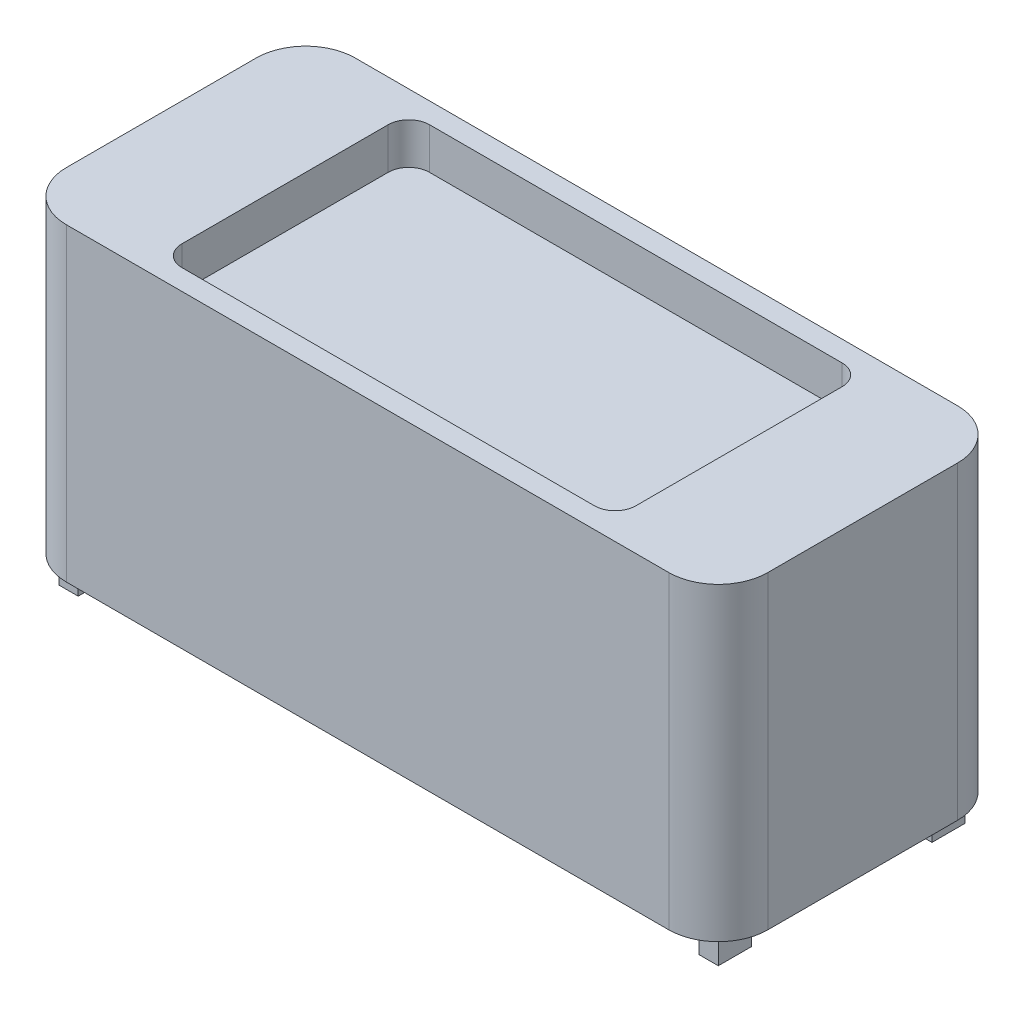
ISO-10303-21;
HEADER;
FILE_DESCRIPTION(('STEP AP214'),'2;1');
FILE_NAME('part.step','',(''),(''),'','','');
FILE_SCHEMA(('AUTOMOTIVE_DESIGN { 1 0 10303 214 1 1 1 1 }'));
ENDSEC;
DATA;
#1=APPLICATION_CONTEXT('core data for automotive mechanical design processes');
#2=APPLICATION_PROTOCOL_DEFINITION('international standard','automotive_design',2000,#1);
#3=PRODUCT_CONTEXT('',#1,'mechanical');
#4=PRODUCT('Part','Part','',(#3));
#5=PRODUCT_RELATED_PRODUCT_CATEGORY('part','',(#4));
#6=PRODUCT_DEFINITION_FORMATION('','',#4);
#7=PRODUCT_DEFINITION_CONTEXT('part definition',#1,'design');
#8=PRODUCT_DEFINITION('design','',#6,#7);
#9=PRODUCT_DEFINITION_SHAPE('','',#8);
#10=(LENGTH_UNIT() NAMED_UNIT(*) SI_UNIT(.MILLI.,.METRE.));
#11=(NAMED_UNIT(*) PLANE_ANGLE_UNIT() SI_UNIT($,.RADIAN.));
#12=(NAMED_UNIT(*) SI_UNIT($,.STERADIAN.) SOLID_ANGLE_UNIT());
#13=UNCERTAINTY_MEASURE_WITH_UNIT(LENGTH_MEASURE(1.E-05),#10,'distance_accuracy_value','');
#14=(GEOMETRIC_REPRESENTATION_CONTEXT(3) GLOBAL_UNCERTAINTY_ASSIGNED_CONTEXT((#13)) GLOBAL_UNIT_ASSIGNED_CONTEXT((#10,
#11,#12)) REPRESENTATION_CONTEXT('',''));
#15=CARTESIAN_POINT('',(0.,0.,0.));
#16=DIRECTION('',(0.,0.,1.));
#17=DIRECTION('',(1.,0.,0.));
#18=AXIS2_PLACEMENT_3D('',#15,#16,#17);
#19=CARTESIAN_POINT('',(0.,-750.,0.));
#20=DIRECTION('',(0.,1.,0.));
#21=DIRECTION('',(0.,0.,1.));
#22=AXIS2_PLACEMENT_3D('',#19,#20,#21);
#23=PLANE('',#22);
#24=DIRECTION('',(1.,0.,0.));
#25=VECTOR('',#24,1.);
#26=CARTESIAN_POINT('',(799.2,-750.,-299.2));
#27=LINE('',#26,#25);
#28=CARTESIAN_POINT('',(752.2,-750.,-299.2));
#29=VERTEX_POINT('',#28);
#30=CARTESIAN_POINT('',(799.2,-750.,-299.2));
#31=VERTEX_POINT('',#30);
#32=EDGE_CURVE('E322',#29,#31,#27,.T.);
#33=ORIENTED_EDGE('',*,*,#32,.F.);
#34=DIRECTION('',(0.,0.,-1.));
#35=VECTOR('',#34,1.);
#36=CARTESIAN_POINT('',(752.2,-750.,-299.2));
#37=LINE('',#36,#35);
#38=CARTESIAN_POINT('',(752.2,-750.,-218.7));
#39=VERTEX_POINT('',#38);
#40=EDGE_CURVE('E338',#39,#29,#37,.T.);
#41=ORIENTED_EDGE('',*,*,#40,.F.);
#42=DIRECTION('',(-1.,0.,0.));
#43=VECTOR('',#42,1.);
#44=CARTESIAN_POINT('',(799.2,-750.,-218.7));
#45=LINE('',#44,#43);
#46=CARTESIAN_POINT('',(799.2,-750.,-218.7));
#47=VERTEX_POINT('',#46);
#48=EDGE_CURVE('E351',#47,#39,#45,.T.);
#49=ORIENTED_EDGE('',*,*,#48,.F.);
#50=DIRECTION('',(0.,0.,1.));
#51=VECTOR('',#50,1.);
#52=CARTESIAN_POINT('',(799.2,-750.,-299.2));
#53=LINE('',#52,#51);
#54=EDGE_CURVE('E327',#31,#47,#53,.T.);
#55=ORIENTED_EDGE('',*,*,#54,.F.);
#56=EDGE_LOOP('',(#33,#41,#49,#55));
#57=FACE_BOUND('',#56,.T.);
#58=DIRECTION('',(0.,0.,-1.));
#59=VECTOR('',#58,1.);
#60=CARTESIAN_POINT('',(-799.2,-750.,299.2));
#61=LINE('',#60,#59);
#62=CARTESIAN_POINT('',(-799.2,-750.,299.2));
#63=VERTEX_POINT('',#62);
#64=CARTESIAN_POINT('',(-799.2,-750.,218.7));
#65=VERTEX_POINT('',#64);
#66=EDGE_CURVE('E418',#63,#65,#61,.T.);
#67=ORIENTED_EDGE('',*,*,#66,.F.);
#68=DIRECTION('',(-1.,0.,0.));
#69=VECTOR('',#68,1.);
#70=CARTESIAN_POINT('',(-799.2,-750.,299.2));
#71=LINE('',#70,#69);
#72=CARTESIAN_POINT('',(-752.2,-750.,299.2));
#73=VERTEX_POINT('',#72);
#74=EDGE_CURVE('E424',#73,#63,#71,.T.);
#75=ORIENTED_EDGE('',*,*,#74,.F.);
#76=DIRECTION('',(0.,0.,1.));
#77=VECTOR('',#76,1.);
#78=CARTESIAN_POINT('',(-752.2,-750.,299.2));
#79=LINE('',#78,#77);
#80=CARTESIAN_POINT('',(-752.2,-750.,218.7));
#81=VERTEX_POINT('',#80);
#82=EDGE_CURVE('E441',#81,#73,#79,.T.);
#83=ORIENTED_EDGE('',*,*,#82,.F.);
#84=DIRECTION('',(1.,0.,0.));
#85=VECTOR('',#84,1.);
#86=CARTESIAN_POINT('',(-799.2,-750.,218.7));
#87=LINE('',#86,#85);
#88=EDGE_CURVE('E437',#65,#81,#87,.T.);
#89=ORIENTED_EDGE('',*,*,#88,.F.);
#90=EDGE_LOOP('',(#67,#75,#83,#89));
#91=FACE_BOUND('',#90,.T.);
#92=DIRECTION('',(1.,0.,0.));
#93=VECTOR('',#92,1.);
#94=CARTESIAN_POINT('',(0.,-750.,-350.));
#95=LINE('',#94,#93);
#96=CARTESIAN_POINT('',(-730.,-750.,-350.));
#97=VERTEX_POINT('',#96);
#98=CARTESIAN_POINT('',(730.,-750.,-350.));
#99=VERTEX_POINT('',#98);
#100=EDGE_CURVE('E496',#97,#99,#95,.T.);
#101=ORIENTED_EDGE('',*,*,#100,.T.);
#102=CARTESIAN_POINT('',(730.,-750.,-230.));
#103=DIRECTION('',(0.,1.,0.));
#104=DIRECTION('',(0.,0.,1.));
#105=AXIS2_PLACEMENT_3D('',#102,#103,#104);
#106=CIRCLE('',#105,120.);
#107=CARTESIAN_POINT('',(850.,-750.,-230.));
#108=VERTEX_POINT('',#107);
#109=EDGE_CURVE('E524',#99,#108,#106,.F.);
#110=ORIENTED_EDGE('',*,*,#109,.T.);
#111=DIRECTION('',(0.,0.,1.));
#112=VECTOR('',#111,1.);
#113=CARTESIAN_POINT('',(850.,-750.,0.));
#114=LINE('',#113,#112);
#115=CARTESIAN_POINT('',(850.,-750.,230.));
#116=VERTEX_POINT('',#115);
#117=EDGE_CURVE('E521',#108,#116,#114,.T.);
#118=ORIENTED_EDGE('',*,*,#117,.T.);
#119=CARTESIAN_POINT('',(730.,-750.,230.));
#120=DIRECTION('',(0.,1.,0.));
#121=DIRECTION('',(0.,0.,1.));
#122=AXIS2_PLACEMENT_3D('',#119,#120,#121);
#123=CIRCLE('',#122,120.);
#124=CARTESIAN_POINT('',(730.,-750.,350.));
#125=VERTEX_POINT('',#124);
#126=EDGE_CURVE('E517',#125,#116,#123,.T.);
#127=ORIENTED_EDGE('',*,*,#126,.F.);
#128=DIRECTION('',(1.,0.,0.));
#129=VECTOR('',#128,1.);
#130=CARTESIAN_POINT('',(0.,-750.,350.));
#131=LINE('',#130,#129);
#132=CARTESIAN_POINT('',(-730.,-750.,350.));
#133=VERTEX_POINT('',#132);
#134=EDGE_CURVE('E513',#133,#125,#131,.T.);
#135=ORIENTED_EDGE('',*,*,#134,.F.);
#136=CARTESIAN_POINT('',(-730.,-750.,230.));
#137=DIRECTION('',(0.,1.,0.));
#138=DIRECTION('',(0.,0.,1.));
#139=AXIS2_PLACEMENT_3D('',#136,#137,#138);
#140=CIRCLE('',#139,120.);
#141=CARTESIAN_POINT('',(-850.,-750.,230.));
#142=VERTEX_POINT('',#141);
#143=EDGE_CURVE('E509',#142,#133,#140,.T.);
#144=ORIENTED_EDGE('',*,*,#143,.F.);
#145=DIRECTION('',(0.,0.,1.));
#146=VECTOR('',#145,1.);
#147=CARTESIAN_POINT('',(-850.,-750.,0.));
#148=LINE('',#147,#146);
#149=CARTESIAN_POINT('',(-850.,-750.,-230.));
#150=VERTEX_POINT('',#149);
#151=EDGE_CURVE('E505',#150,#142,#148,.T.);
#152=ORIENTED_EDGE('',*,*,#151,.F.);
#153=CARTESIAN_POINT('',(-730.,-750.,-230.));
#154=DIRECTION('',(0.,1.,0.));
#155=DIRECTION('',(0.,0.,1.));
#156=AXIS2_PLACEMENT_3D('',#153,#154,#155);
#157=CIRCLE('',#156,120.);
#158=EDGE_CURVE('E500',#97,#150,#157,.T.);
#159=ORIENTED_EDGE('',*,*,#158,.F.);
#160=EDGE_LOOP('',(#101,#110,#118,#127,#135,#144,#152,#159));
#161=FACE_BOUND('',#160,.T.);
#162=DIRECTION('',(0.,0.,1.));
#163=VECTOR('',#162,1.);
#164=CARTESIAN_POINT('',(799.2,-750.,299.2));
#165=LINE('',#164,#163);
#166=CARTESIAN_POINT('',(799.2,-750.,218.7));
#167=VERTEX_POINT('',#166);
#168=CARTESIAN_POINT('',(799.2,-750.,299.2));
#169=VERTEX_POINT('',#168);
#170=EDGE_CURVE('E373',#167,#169,#165,.T.);
#171=ORIENTED_EDGE('',*,*,#170,.F.);
#172=DIRECTION('',(1.,0.,0.));
#173=VECTOR('',#172,1.);
#174=CARTESIAN_POINT('',(799.2,-750.,218.7));
#175=LINE('',#174,#173);
#176=CARTESIAN_POINT('',(752.2,-750.,218.7));
#177=VERTEX_POINT('',#176);
#178=EDGE_CURVE('E379',#177,#167,#175,.T.);
#179=ORIENTED_EDGE('',*,*,#178,.F.);
#180=DIRECTION('',(0.,0.,-1.));
#181=VECTOR('',#180,1.);
#182=CARTESIAN_POINT('',(752.2,-750.,299.2));
#183=LINE('',#182,#181);
#184=CARTESIAN_POINT('',(752.2,-750.,299.2));
#185=VERTEX_POINT('',#184);
#186=EDGE_CURVE('E396',#185,#177,#183,.T.);
#187=ORIENTED_EDGE('',*,*,#186,.F.);
#188=DIRECTION('',(-1.,0.,0.));
#189=VECTOR('',#188,1.);
#190=CARTESIAN_POINT('',(799.2,-750.,299.2));
#191=LINE('',#190,#189);
#192=EDGE_CURVE('E392',#169,#185,#191,.T.);
#193=ORIENTED_EDGE('',*,*,#192,.F.);
#194=EDGE_LOOP('',(#171,#179,#187,#193));
#195=FACE_BOUND('',#194,.T.);
#196=DIRECTION('',(0.,0.,-1.));
#197=VECTOR('',#196,1.);
#198=CARTESIAN_POINT('',(-799.2,-750.,-299.2));
#199=LINE('',#198,#197);
#200=CARTESIAN_POINT('',(-799.2,-750.,-218.7));
#201=VERTEX_POINT('',#200);
#202=CARTESIAN_POINT('',(-799.2,-750.,-299.2));
#203=VERTEX_POINT('',#202);
#204=EDGE_CURVE('E320',#201,#203,#199,.T.);
#205=ORIENTED_EDGE('',*,*,#204,.F.);
#206=DIRECTION('',(-1.,0.,0.));
#207=VECTOR('',#206,1.);
#208=CARTESIAN_POINT('',(-799.2,-750.,-218.7));
#209=LINE('',#208,#207);
#210=CARTESIAN_POINT('',(-752.2,-750.,-218.7));
#211=VERTEX_POINT('',#210);
#212=EDGE_CURVE('E317',#211,#201,#209,.T.);
#213=ORIENTED_EDGE('',*,*,#212,.F.);
#214=DIRECTION('',(0.,0.,1.));
#215=VECTOR('',#214,1.);
#216=CARTESIAN_POINT('',(-752.2,-750.,-299.2));
#217=LINE('',#216,#215);
#218=CARTESIAN_POINT('',(-752.2,-750.,-299.2));
#219=VERTEX_POINT('',#218);
#220=EDGE_CURVE('E110',#219,#211,#217,.T.);
#221=ORIENTED_EDGE('',*,*,#220,.F.);
#222=DIRECTION('',(1.,0.,0.));
#223=VECTOR('',#222,1.);
#224=CARTESIAN_POINT('',(-799.2,-750.,-299.2));
#225=LINE('',#224,#223);
#226=EDGE_CURVE('E105',#203,#219,#225,.T.);
#227=ORIENTED_EDGE('',*,*,#226,.F.);
#228=EDGE_LOOP('',(#205,#213,#221,#227));
#229=FACE_BOUND('',#228,.T.);
#230=ADVANCED_FACE('F89',(#57,#91,#161,#195,#229),#23,.F.);
#231=CARTESIAN_POINT('',(0.,0.,0.));
#232=DIRECTION('',(0.,1.,0.));
#233=DIRECTION('',(0.,0.,1.));
#234=AXIS2_PLACEMENT_3D('',#231,#232,#233);
#235=PLANE('',#234);
#236=DIRECTION('',(1.,0.,0.));
#237=VECTOR('',#236,1.);
#238=CARTESIAN_POINT('',(0.,0.,-350.));
#239=LINE('',#238,#237);
#240=CARTESIAN_POINT('',(-730.,0.,-350.));
#241=VERTEX_POINT('',#240);
#242=CARTESIAN_POINT('',(730.,0.,-350.));
#243=VERTEX_POINT('',#242);
#244=EDGE_CURVE('E481',#241,#243,#239,.T.);
#245=ORIENTED_EDGE('',*,*,#244,.F.);
#246=CARTESIAN_POINT('',(-730.,0.,-230.));
#247=DIRECTION('',(0.,1.,0.));
#248=DIRECTION('',(0.,0.,1.));
#249=AXIS2_PLACEMENT_3D('',#246,#247,#248);
#250=CIRCLE('',#249,120.);
#251=CARTESIAN_POINT('',(-850.,0.,-230.));
#252=VERTEX_POINT('',#251);
#253=EDGE_CURVE('E531',#241,#252,#250,.T.);
#254=ORIENTED_EDGE('',*,*,#253,.T.);
#255=DIRECTION('',(0.,0.,1.));
#256=VECTOR('',#255,1.);
#257=CARTESIAN_POINT('',(-850.,0.,0.));
#258=LINE('',#257,#256);
#259=CARTESIAN_POINT('',(-850.,0.,230.));
#260=VERTEX_POINT('',#259);
#261=EDGE_CURVE('E535',#252,#260,#258,.T.);
#262=ORIENTED_EDGE('',*,*,#261,.T.);
#263=CARTESIAN_POINT('',(-730.,0.,230.));
#264=DIRECTION('',(0.,1.,0.));
#265=DIRECTION('',(0.,0.,1.));
#266=AXIS2_PLACEMENT_3D('',#263,#264,#265);
#267=CIRCLE('',#266,120.);
#268=CARTESIAN_POINT('',(-730.,0.,350.));
#269=VERTEX_POINT('',#268);
#270=EDGE_CURVE('E539',#260,#269,#267,.T.);
#271=ORIENTED_EDGE('',*,*,#270,.T.);
#272=DIRECTION('',(1.,0.,0.));
#273=VECTOR('',#272,1.);
#274=CARTESIAN_POINT('',(0.,0.,350.));
#275=LINE('',#274,#273);
#276=CARTESIAN_POINT('',(730.,0.,350.));
#277=VERTEX_POINT('',#276);
#278=EDGE_CURVE('E543',#269,#277,#275,.T.);
#279=ORIENTED_EDGE('',*,*,#278,.T.);
#280=CARTESIAN_POINT('',(730.,0.,230.));
#281=DIRECTION('',(0.,1.,0.));
#282=DIRECTION('',(0.,0.,1.));
#283=AXIS2_PLACEMENT_3D('',#280,#281,#282);
#284=CIRCLE('',#283,120.);
#285=CARTESIAN_POINT('',(850.,0.,230.));
#286=VERTEX_POINT('',#285);
#287=EDGE_CURVE('E547',#277,#286,#284,.T.);
#288=ORIENTED_EDGE('',*,*,#287,.T.);
#289=DIRECTION('',(0.,0.,1.));
#290=VECTOR('',#289,1.);
#291=CARTESIAN_POINT('',(850.,0.,0.));
#292=LINE('',#291,#290);
#293=CARTESIAN_POINT('',(850.,0.,-230.));
#294=VERTEX_POINT('',#293);
#295=EDGE_CURVE('E551',#294,#286,#292,.T.);
#296=ORIENTED_EDGE('',*,*,#295,.F.);
#297=CARTESIAN_POINT('',(730.,0.,-230.));
#298=DIRECTION('',(0.,1.,0.));
#299=DIRECTION('',(0.,0.,1.));
#300=AXIS2_PLACEMENT_3D('',#297,#298,#299);
#301=CIRCLE('',#300,120.);
#302=EDGE_CURVE('E501',#243,#294,#301,.F.);
#303=ORIENTED_EDGE('',*,*,#302,.F.);
#304=EDGE_LOOP('',(#245,#254,#262,#271,#279,#288,#296,#303));
#305=FACE_BOUND('',#304,.T.);
#306=DIRECTION('',(0.,0.,1.));
#307=VECTOR('',#306,1.);
#308=CARTESIAN_POINT('',(-550.,0.,1.01770443923973E-13));
#309=LINE('',#308,#307);
#310=CARTESIAN_POINT('',(-550.,0.,-249.999999924));
#311=VERTEX_POINT('',#310);
#312=CARTESIAN_POINT('',(-550.,0.,249.999999924));
#313=VERTEX_POINT('',#312);
#314=EDGE_CURVE('E489',#311,#313,#309,.T.);
#315=ORIENTED_EDGE('',*,*,#314,.F.);
#316=CARTESIAN_POINT('',(-499.999999924,0.,-249.999999924));
#317=DIRECTION('',(0.,1.,0.));
#318=DIRECTION('',(0.,0.,1.));
#319=AXIS2_PLACEMENT_3D('',#316,#317,#318);
#320=CIRCLE('',#319,50.000000076);
#321=CARTESIAN_POINT('',(-499.999999924,0.,-300.));
#322=VERTEX_POINT('',#321);
#323=EDGE_CURVE('E12',#311,#322,#320,.F.);
#324=ORIENTED_EDGE('',*,*,#323,.T.);
#325=DIRECTION('',(1.,0.,0.));
#326=VECTOR('',#325,1.);
#327=CARTESIAN_POINT('',(0.,0.,-300.));
#328=LINE('',#327,#326);
#329=CARTESIAN_POINT('',(499.999999924,0.,-300.));
#330=VERTEX_POINT('',#329);
#331=EDGE_CURVE('E485',#322,#330,#328,.T.);
#332=ORIENTED_EDGE('',*,*,#331,.T.);
#333=CARTESIAN_POINT('',(499.999999924,0.,-249.999999924));
#334=DIRECTION('',(0.,1.,0.));
#335=DIRECTION('',(0.,0.,1.));
#336=AXIS2_PLACEMENT_3D('',#333,#334,#335);
#337=CIRCLE('',#336,50.000000076);
#338=CARTESIAN_POINT('',(550.,0.,-249.999999924));
#339=VERTEX_POINT('',#338);
#340=EDGE_CURVE('E98',#330,#339,#337,.F.);
#341=ORIENTED_EDGE('',*,*,#340,.T.);
#342=DIRECTION('',(0.,0.,1.));
#343=VECTOR('',#342,1.);
#344=CARTESIAN_POINT('',(550.,0.,-1.01770443923973E-13));
#345=LINE('',#344,#343);
#346=CARTESIAN_POINT('',(550.,0.,249.999999924));
#347=VERTEX_POINT('',#346);
#348=EDGE_CURVE('E463',#339,#347,#345,.T.);
#349=ORIENTED_EDGE('',*,*,#348,.T.);
#350=CARTESIAN_POINT('',(499.999999924,0.,249.999999924));
#351=DIRECTION('',(0.,1.,0.));
#352=DIRECTION('',(0.,0.,1.));
#353=AXIS2_PLACEMENT_3D('',#350,#351,#352);
#354=CIRCLE('',#353,50.000000076);
#355=CARTESIAN_POINT('',(499.999999924,0.,300.));
#356=VERTEX_POINT('',#355);
#357=EDGE_CURVE('E622',#347,#356,#354,.F.);
#358=ORIENTED_EDGE('',*,*,#357,.T.);
#359=DIRECTION('',(1.,0.,0.));
#360=VECTOR('',#359,1.);
#361=CARTESIAN_POINT('',(0.,0.,300.));
#362=LINE('',#361,#360);
#363=CARTESIAN_POINT('',(-499.999999924,0.,300.));
#364=VERTEX_POINT('',#363);
#365=EDGE_CURVE('E469',#364,#356,#362,.T.);
#366=ORIENTED_EDGE('',*,*,#365,.F.);
#367=CARTESIAN_POINT('',(-499.999999924,0.,249.999999924));
#368=DIRECTION('',(0.,1.,0.));
#369=DIRECTION('',(0.,0.,1.));
#370=AXIS2_PLACEMENT_3D('',#367,#368,#369);
#371=CIRCLE('',#370,50.000000076);
#372=EDGE_CURVE('E625',#364,#313,#371,.F.);
#373=ORIENTED_EDGE('',*,*,#372,.T.);
#374=EDGE_LOOP('',(#315,#324,#332,#341,#349,#358,#366,#373));
#375=FACE_BOUND('',#374,.T.);
#376=ADVANCED_FACE('F631',(#305,#375),#235,.T.);
#377=CARTESIAN_POINT('',(-730.,-750.,230.));
#378=DIRECTION('',(0.,1.,0.));
#379=DIRECTION('',(0.,0.,1.));
#380=AXIS2_PLACEMENT_3D('',#377,#378,#379);
#381=CYLINDRICAL_SURFACE('',#380,120.);
#382=ORIENTED_EDGE('',*,*,#270,.F.);
#383=DIRECTION('',(0.,1.,0.));
#384=VECTOR('',#383,1.);
#385=CARTESIAN_POINT('',(-850.,-750.,230.));
#386=LINE('',#385,#384);
#387=EDGE_CURVE('E575',#142,#260,#386,.T.);
#388=ORIENTED_EDGE('',*,*,#387,.F.);
#389=ORIENTED_EDGE('',*,*,#143,.T.);
#390=DIRECTION('',(0.,1.,0.));
#391=VECTOR('',#390,1.);
#392=CARTESIAN_POINT('',(-730.,-750.,350.));
#393=LINE('',#392,#391);
#394=EDGE_CURVE('E572',#133,#269,#393,.T.);
#395=ORIENTED_EDGE('',*,*,#394,.T.);
#396=EDGE_LOOP('',(#382,#388,#389,#395));
#397=FACE_BOUND('',#396,.T.);
#398=ADVANCED_FACE('F682',(#397),#381,.T.);
#399=CARTESIAN_POINT('',(0.,-750.,350.));
#400=DIRECTION('',(0.,0.,1.));
#401=DIRECTION('',(1.,0.,0.));
#402=AXIS2_PLACEMENT_3D('',#399,#400,#401);
#403=PLANE('',#402);
#404=ORIENTED_EDGE('',*,*,#278,.F.);
#405=ORIENTED_EDGE('',*,*,#394,.F.);
#406=ORIENTED_EDGE('',*,*,#134,.T.);
#407=DIRECTION('',(0.,1.,0.));
#408=VECTOR('',#407,1.);
#409=CARTESIAN_POINT('',(730.,-750.,350.));
#410=LINE('',#409,#408);
#411=EDGE_CURVE('E569',#125,#277,#410,.T.);
#412=ORIENTED_EDGE('',*,*,#411,.T.);
#413=EDGE_LOOP('',(#404,#405,#406,#412));
#414=FACE_BOUND('',#413,.T.);
#415=ADVANCED_FACE('F701',(#414),#403,.T.);
#416=CARTESIAN_POINT('',(730.,-750.,230.));
#417=DIRECTION('',(0.,1.,0.));
#418=DIRECTION('',(0.,0.,1.));
#419=AXIS2_PLACEMENT_3D('',#416,#417,#418);
#420=CYLINDRICAL_SURFACE('',#419,120.);
#421=ORIENTED_EDGE('',*,*,#287,.F.);
#422=ORIENTED_EDGE('',*,*,#411,.F.);
#423=ORIENTED_EDGE('',*,*,#126,.T.);
#424=DIRECTION('',(0.,1.,0.));
#425=VECTOR('',#424,1.);
#426=CARTESIAN_POINT('',(850.,-750.,230.));
#427=LINE('',#426,#425);
#428=EDGE_CURVE('E566',#116,#286,#427,.T.);
#429=ORIENTED_EDGE('',*,*,#428,.T.);
#430=EDGE_LOOP('',(#421,#422,#423,#429));
#431=FACE_BOUND('',#430,.T.);
#432=ADVANCED_FACE('F697',(#431),#420,.T.);
#433=CARTESIAN_POINT('',(850.,-750.,0.));
#434=DIRECTION('',(-1.,0.,0.));
#435=DIRECTION('',(0.,0.,1.));
#436=AXIS2_PLACEMENT_3D('',#433,#434,#435);
#437=PLANE('',#436);
#438=ORIENTED_EDGE('',*,*,#295,.T.);
#439=ORIENTED_EDGE('',*,*,#428,.F.);
#440=ORIENTED_EDGE('',*,*,#117,.F.);
#441=DIRECTION('',(0.,1.,0.));
#442=VECTOR('',#441,1.);
#443=CARTESIAN_POINT('',(850.,-750.,-230.));
#444=LINE('',#443,#442);
#445=EDGE_CURVE('E562',#108,#294,#444,.T.);
#446=ORIENTED_EDGE('',*,*,#445,.T.);
#447=EDGE_LOOP('',(#438,#439,#440,#446));
#448=FACE_BOUND('',#447,.T.);
#449=ADVANCED_FACE('F693',(#448),#437,.F.);
#450=CARTESIAN_POINT('',(730.,-750.,-230.));
#451=DIRECTION('',(0.,1.,0.));
#452=DIRECTION('',(0.,0.,1.));
#453=AXIS2_PLACEMENT_3D('',#450,#451,#452);
#454=CYLINDRICAL_SURFACE('',#453,120.);
#455=ORIENTED_EDGE('',*,*,#302,.T.);
#456=ORIENTED_EDGE('',*,*,#445,.F.);
#457=ORIENTED_EDGE('',*,*,#109,.F.);
#458=DIRECTION('',(0.,1.,0.));
#459=VECTOR('',#458,1.);
#460=CARTESIAN_POINT('',(730.,-750.,-350.));
#461=LINE('',#460,#459);
#462=EDGE_CURVE('E557',#99,#243,#461,.T.);
#463=ORIENTED_EDGE('',*,*,#462,.T.);
#464=EDGE_LOOP('',(#455,#456,#457,#463));
#465=FACE_BOUND('',#464,.T.);
#466=ADVANCED_FACE('F689',(#465),#454,.T.);
#467=CARTESIAN_POINT('',(0.,-750.,-350.));
#468=DIRECTION('',(0.,0.,1.));
#469=DIRECTION('',(1.,0.,0.));
#470=AXIS2_PLACEMENT_3D('',#467,#468,#469);
#471=PLANE('',#470);
#472=ORIENTED_EDGE('',*,*,#244,.T.);
#473=ORIENTED_EDGE('',*,*,#462,.F.);
#474=ORIENTED_EDGE('',*,*,#100,.F.);
#475=DIRECTION('',(0.,1.,0.));
#476=VECTOR('',#475,1.);
#477=CARTESIAN_POINT('',(-730.,-750.,-350.));
#478=LINE('',#477,#476);
#479=EDGE_CURVE('E527',#97,#241,#478,.T.);
#480=ORIENTED_EDGE('',*,*,#479,.T.);
#481=EDGE_LOOP('',(#472,#473,#474,#480));
#482=FACE_BOUND('',#481,.T.);
#483=ADVANCED_FACE('F692',(#482),#471,.F.);
#484=CARTESIAN_POINT('',(-730.,-750.,-230.));
#485=DIRECTION('',(0.,1.,0.));
#486=DIRECTION('',(0.,0.,1.));
#487=AXIS2_PLACEMENT_3D('',#484,#485,#486);
#488=CYLINDRICAL_SURFACE('',#487,120.);
#489=ORIENTED_EDGE('',*,*,#253,.F.);
#490=ORIENTED_EDGE('',*,*,#479,.F.);
#491=ORIENTED_EDGE('',*,*,#158,.T.);
#492=DIRECTION('',(0.,1.,0.));
#493=VECTOR('',#492,1.);
#494=CARTESIAN_POINT('',(-850.,-750.,-230.));
#495=LINE('',#494,#493);
#496=EDGE_CURVE('E578',#150,#252,#495,.T.);
#497=ORIENTED_EDGE('',*,*,#496,.T.);
#498=EDGE_LOOP('',(#489,#490,#491,#497));
#499=FACE_BOUND('',#498,.T.);
#500=ADVANCED_FACE('F712',(#499),#488,.T.);
#501=CARTESIAN_POINT('',(-850.,-750.,0.));
#502=DIRECTION('',(-1.,0.,0.));
#503=DIRECTION('',(0.,0.,1.));
#504=AXIS2_PLACEMENT_3D('',#501,#502,#503);
#505=PLANE('',#504);
#506=ORIENTED_EDGE('',*,*,#261,.F.);
#507=ORIENTED_EDGE('',*,*,#496,.F.);
#508=ORIENTED_EDGE('',*,*,#151,.T.);
#509=ORIENTED_EDGE('',*,*,#387,.T.);
#510=EDGE_LOOP('',(#506,#507,#508,#509));
#511=FACE_BOUND('',#510,.T.);
#512=ADVANCED_FACE('F709',(#511),#505,.T.);
#513=CARTESIAN_POINT('',(550.,-100.,-1.01770443923973E-13));
#514=DIRECTION('',(-1.,0.,0.));
#515=DIRECTION('',(0.,0.,1.));
#516=AXIS2_PLACEMENT_3D('',#513,#514,#515);
#517=PLANE('',#516);
#518=DIRECTION('',(0.,0.,1.));
#519=VECTOR('',#518,1.);
#520=CARTESIAN_POINT('',(550.,-100.,-1.01770443923973E-13));
#521=LINE('',#520,#519);
#522=CARTESIAN_POINT('',(550.,-100.,-249.999999924));
#523=VERTEX_POINT('',#522);
#524=CARTESIAN_POINT('',(550.,-100.,249.999999924));
#525=VERTEX_POINT('',#524);
#526=EDGE_CURVE('E464',#523,#525,#521,.T.);
#527=ORIENTED_EDGE('',*,*,#526,.T.);
#528=DIRECTION('',(0.,1.,0.));
#529=VECTOR('',#528,1.);
#530=CARTESIAN_POINT('',(550.,-100.,249.999999924));
#531=LINE('',#530,#529);
#532=EDGE_CURVE('E585',#525,#347,#531,.T.);
#533=ORIENTED_EDGE('',*,*,#532,.T.);
#534=ORIENTED_EDGE('',*,*,#348,.F.);
#535=DIRECTION('',(0.,1.,0.));
#536=VECTOR('',#535,1.);
#537=CARTESIAN_POINT('',(550.,-100.,-249.999999924));
#538=LINE('',#537,#536);
#539=EDGE_CURVE('E561',#339,#523,#538,.F.);
#540=ORIENTED_EDGE('',*,*,#539,.T.);
#541=EDGE_LOOP('',(#527,#533,#534,#540));
#542=FACE_BOUND('',#541,.T.);
#543=ADVANCED_FACE('F637',(#542),#517,.T.);
#544=CARTESIAN_POINT('',(0.,-100.,300.));
#545=DIRECTION('',(0.,0.,1.));
#546=DIRECTION('',(1.,0.,0.));
#547=AXIS2_PLACEMENT_3D('',#544,#545,#546);
#548=PLANE('',#547);
#549=ORIENTED_EDGE('',*,*,#365,.T.);
#550=DIRECTION('',(0.,1.,0.));
#551=VECTOR('',#550,1.);
#552=CARTESIAN_POINT('',(499.999999924,-100.,300.));
#553=LINE('',#552,#551);
#554=CARTESIAN_POINT('',(499.999999924,-100.,300.));
#555=VERTEX_POINT('',#554);
#556=EDGE_CURVE('E593',#356,#555,#553,.F.);
#557=ORIENTED_EDGE('',*,*,#556,.T.);
#558=DIRECTION('',(1.,0.,0.));
#559=VECTOR('',#558,1.);
#560=CARTESIAN_POINT('',(0.,-100.,300.));
#561=LINE('',#560,#559);
#562=CARTESIAN_POINT('',(-499.999999924,-100.,300.));
#563=VERTEX_POINT('',#562);
#564=EDGE_CURVE('E477',#563,#555,#561,.T.);
#565=ORIENTED_EDGE('',*,*,#564,.F.);
#566=DIRECTION('',(0.,1.,0.));
#567=VECTOR('',#566,1.);
#568=CARTESIAN_POINT('',(-499.999999924,0.,300.));
#569=LINE('',#568,#567);
#570=EDGE_CURVE('E589',#563,#364,#569,.T.);
#571=ORIENTED_EDGE('',*,*,#570,.T.);
#572=EDGE_LOOP('',(#549,#557,#565,#571));
#573=FACE_BOUND('',#572,.T.);
#574=ADVANCED_FACE('F662',(#573),#548,.F.);
#575=CARTESIAN_POINT('',(-550.,-100.,1.01770443923973E-13));
#576=DIRECTION('',(-1.,0.,0.));
#577=DIRECTION('',(0.,0.,1.));
#578=AXIS2_PLACEMENT_3D('',#575,#576,#577);
#579=PLANE('',#578);
#580=ORIENTED_EDGE('',*,*,#314,.T.);
#581=DIRECTION('',(0.,1.,0.));
#582=VECTOR('',#581,1.);
#583=CARTESIAN_POINT('',(-550.,-100.,249.999999924));
#584=LINE('',#583,#582);
#585=CARTESIAN_POINT('',(-550.,-100.,249.999999924));
#586=VERTEX_POINT('',#585);
#587=EDGE_CURVE('E612',#313,#586,#584,.F.);
#588=ORIENTED_EDGE('',*,*,#587,.T.);
#589=DIRECTION('',(0.,0.,1.));
#590=VECTOR('',#589,1.);
#591=CARTESIAN_POINT('',(-550.,-100.,1.01770443923973E-13));
#592=LINE('',#591,#590);
#593=CARTESIAN_POINT('',(-550.,-100.,-249.999999924));
#594=VERTEX_POINT('',#593);
#595=EDGE_CURVE('E473',#594,#586,#592,.T.);
#596=ORIENTED_EDGE('',*,*,#595,.F.);
#597=DIRECTION('',(0.,1.,0.));
#598=VECTOR('',#597,1.);
#599=CARTESIAN_POINT('',(-550.,-100.,-249.999999924));
#600=LINE('',#599,#598);
#601=EDGE_CURVE('E608',#594,#311,#600,.T.);
#602=ORIENTED_EDGE('',*,*,#601,.T.);
#603=EDGE_LOOP('',(#580,#588,#596,#602));
#604=FACE_BOUND('',#603,.T.);
#605=ADVANCED_FACE('F654',(#604),#579,.F.);
#606=CARTESIAN_POINT('',(0.,-100.,-300.));
#607=DIRECTION('',(0.,0.,1.));
#608=DIRECTION('',(1.,0.,0.));
#609=AXIS2_PLACEMENT_3D('',#606,#607,#608);
#610=PLANE('',#609);
#611=DIRECTION('',(1.,0.,0.));
#612=VECTOR('',#611,1.);
#613=CARTESIAN_POINT('',(0.,-100.,-300.));
#614=LINE('',#613,#612);
#615=CARTESIAN_POINT('',(-499.999999924,-100.,-300.));
#616=VERTEX_POINT('',#615);
#617=CARTESIAN_POINT('',(499.999999924,-100.,-300.));
#618=VERTEX_POINT('',#617);
#619=EDGE_CURVE('E468',#616,#618,#614,.T.);
#620=ORIENTED_EDGE('',*,*,#619,.T.);
#621=DIRECTION('',(0.,1.,0.));
#622=VECTOR('',#621,1.);
#623=CARTESIAN_POINT('',(499.999999924,0.,-300.));
#624=LINE('',#623,#622);
#625=EDGE_CURVE('E618',#618,#330,#624,.T.);
#626=ORIENTED_EDGE('',*,*,#625,.T.);
#627=ORIENTED_EDGE('',*,*,#331,.F.);
#628=DIRECTION('',(0.,1.,0.));
#629=VECTOR('',#628,1.);
#630=CARTESIAN_POINT('',(-499.999999924,-100.,-300.));
#631=LINE('',#630,#629);
#632=EDGE_CURVE('E615',#322,#616,#631,.F.);
#633=ORIENTED_EDGE('',*,*,#632,.T.);
#634=EDGE_LOOP('',(#620,#626,#627,#633));
#635=FACE_BOUND('',#634,.T.);
#636=ADVANCED_FACE('F647',(#635),#610,.T.);
#637=CARTESIAN_POINT('',(0.,-100.,0.));
#638=DIRECTION('',(0.,1.,0.));
#639=DIRECTION('',(0.,0.,1.));
#640=AXIS2_PLACEMENT_3D('',#637,#638,#639);
#641=PLANE('',#640);
#642=ORIENTED_EDGE('',*,*,#564,.T.);
#643=CARTESIAN_POINT('',(499.999999924,-100.,249.999999924));
#644=DIRECTION('',(0.,1.,0.));
#645=DIRECTION('',(0.,0.,1.));
#646=AXIS2_PLACEMENT_3D('',#643,#644,#645);
#647=CIRCLE('',#646,50.000000076);
#648=EDGE_CURVE('E605',#555,#525,#647,.T.);
#649=ORIENTED_EDGE('',*,*,#648,.T.);
#650=ORIENTED_EDGE('',*,*,#526,.F.);
#651=CARTESIAN_POINT('',(499.999999924,-100.,-249.999999924));
#652=DIRECTION('',(0.,1.,0.));
#653=DIRECTION('',(0.,0.,1.));
#654=AXIS2_PLACEMENT_3D('',#651,#652,#653);
#655=CIRCLE('',#654,50.000000076);
#656=EDGE_CURVE('E599',#523,#618,#655,.T.);
#657=ORIENTED_EDGE('',*,*,#656,.T.);
#658=ORIENTED_EDGE('',*,*,#619,.F.);
#659=CARTESIAN_POINT('',(-499.999999924,-100.,-249.999999924));
#660=DIRECTION('',(0.,1.,0.));
#661=DIRECTION('',(0.,0.,1.));
#662=AXIS2_PLACEMENT_3D('',#659,#660,#661);
#663=CIRCLE('',#662,50.000000076);
#664=EDGE_CURVE('E596',#616,#594,#663,.T.);
#665=ORIENTED_EDGE('',*,*,#664,.T.);
#666=ORIENTED_EDGE('',*,*,#595,.T.);
#667=CARTESIAN_POINT('',(-499.999999924,-100.,249.999999924));
#668=DIRECTION('',(0.,1.,0.));
#669=DIRECTION('',(0.,0.,1.));
#670=AXIS2_PLACEMENT_3D('',#667,#668,#669);
#671=CIRCLE('',#670,50.000000076);
#672=EDGE_CURVE('E602',#586,#563,#671,.T.);
#673=ORIENTED_EDGE('',*,*,#672,.T.);
#674=EDGE_LOOP('',(#642,#649,#650,#657,#658,#665,#666,#673));
#675=FACE_BOUND('',#674,.T.);
#676=ADVANCED_FACE('F644',(#675),#641,.T.);
#677=CARTESIAN_POINT('',(499.999999924,-100.,249.999999924));
#678=DIRECTION('',(0.,1.,0.));
#679=DIRECTION('',(0.,0.,1.));
#680=AXIS2_PLACEMENT_3D('',#677,#678,#679);
#681=CYLINDRICAL_SURFACE('',#680,50.000000076);
#682=ORIENTED_EDGE('',*,*,#648,.F.);
#683=ORIENTED_EDGE('',*,*,#556,.F.);
#684=ORIENTED_EDGE('',*,*,#357,.F.);
#685=ORIENTED_EDGE('',*,*,#532,.F.);
#686=EDGE_LOOP('',(#682,#683,#684,#685));
#687=FACE_BOUND('',#686,.T.);
#688=ADVANCED_FACE('F666',(#687),#681,.F.);
#689=CARTESIAN_POINT('',(-499.999999924,-100.,249.999999924));
#690=DIRECTION('',(0.,-1.,0.));
#691=DIRECTION('',(0.,0.,-1.));
#692=AXIS2_PLACEMENT_3D('',#689,#690,#691);
#693=CYLINDRICAL_SURFACE('',#692,50.000000076);
#694=ORIENTED_EDGE('',*,*,#672,.F.);
#695=ORIENTED_EDGE('',*,*,#587,.F.);
#696=ORIENTED_EDGE('',*,*,#372,.F.);
#697=ORIENTED_EDGE('',*,*,#570,.F.);
#698=EDGE_LOOP('',(#694,#695,#696,#697));
#699=FACE_BOUND('',#698,.T.);
#700=ADVANCED_FACE('F657',(#699),#693,.F.);
#701=CARTESIAN_POINT('',(499.999999924,-100.,-249.999999924));
#702=DIRECTION('',(0.,-1.,0.));
#703=DIRECTION('',(0.,0.,-1.));
#704=AXIS2_PLACEMENT_3D('',#701,#702,#703);
#705=CYLINDRICAL_SURFACE('',#704,50.000000076);
#706=ORIENTED_EDGE('',*,*,#656,.F.);
#707=ORIENTED_EDGE('',*,*,#539,.F.);
#708=ORIENTED_EDGE('',*,*,#340,.F.);
#709=ORIENTED_EDGE('',*,*,#625,.F.);
#710=EDGE_LOOP('',(#706,#707,#708,#709));
#711=FACE_BOUND('',#710,.T.);
#712=ADVANCED_FACE('F641',(#711),#705,.F.);
#713=CARTESIAN_POINT('',(-499.999999924,-100.,-249.999999924));
#714=DIRECTION('',(0.,1.,0.));
#715=DIRECTION('',(0.,0.,1.));
#716=AXIS2_PLACEMENT_3D('',#713,#714,#715);
#717=CYLINDRICAL_SURFACE('',#716,50.000000076);
#718=ORIENTED_EDGE('',*,*,#664,.F.);
#719=ORIENTED_EDGE('',*,*,#632,.F.);
#720=ORIENTED_EDGE('',*,*,#323,.F.);
#721=ORIENTED_EDGE('',*,*,#601,.F.);
#722=EDGE_LOOP('',(#718,#719,#720,#721));
#723=FACE_BOUND('',#722,.T.);
#724=ADVANCED_FACE('F91',(#723),#717,.F.);
#725=CARTESIAN_POINT('',(-799.2,-816.215,299.2));
#726=DIRECTION('',(1.,0.,0.));
#727=DIRECTION('',(0.,0.,-1.));
#728=AXIS2_PLACEMENT_3D('',#725,#726,#727);
#729=PLANE('',#728);
#730=ORIENTED_EDGE('',*,*,#66,.T.);
#731=DIRECTION('',(0.,1.,0.));
#732=VECTOR('',#731,1.);
#733=CARTESIAN_POINT('',(-799.2,-816.215,218.7));
#734=LINE('',#733,#732);
#735=CARTESIAN_POINT('',(-799.2,-816.215,218.7));
#736=VERTEX_POINT('',#735);
#737=EDGE_CURVE('E459',#736,#65,#734,.T.);
#738=ORIENTED_EDGE('',*,*,#737,.F.);
#739=DIRECTION('',(0.,0.,-1.));
#740=VECTOR('',#739,1.);
#741=CARTESIAN_POINT('',(-799.2,-816.215,299.2));
#742=LINE('',#741,#740);
#743=CARTESIAN_POINT('',(-799.2,-816.215,299.2));
#744=VERTEX_POINT('',#743);
#745=EDGE_CURVE('E419',#744,#736,#742,.T.);
#746=ORIENTED_EDGE('',*,*,#745,.F.);
#747=DIRECTION('',(0.,1.,0.));
#748=VECTOR('',#747,1.);
#749=CARTESIAN_POINT('',(-799.2,-816.215,299.2));
#750=LINE('',#749,#748);
#751=EDGE_CURVE('E433',#744,#63,#750,.T.);
#752=ORIENTED_EDGE('',*,*,#751,.T.);
#753=EDGE_LOOP('',(#730,#738,#746,#752));
#754=FACE_BOUND('',#753,.T.);
#755=ADVANCED_FACE('F829',(#754),#729,.F.);
#756=CARTESIAN_POINT('',(-799.2,-816.215,218.7));
#757=DIRECTION('',(0.,0.,1.));
#758=DIRECTION('',(1.,0.,0.));
#759=AXIS2_PLACEMENT_3D('',#756,#757,#758);
#760=PLANE('',#759);
#761=ORIENTED_EDGE('',*,*,#88,.T.);
#762=DIRECTION('',(0.,1.,0.));
#763=VECTOR('',#762,1.);
#764=CARTESIAN_POINT('',(-752.2,-816.215,218.7));
#765=LINE('',#764,#763);
#766=CARTESIAN_POINT('',(-752.2,-816.215,218.7));
#767=VERTEX_POINT('',#766);
#768=EDGE_CURVE('E455',#767,#81,#765,.T.);
#769=ORIENTED_EDGE('',*,*,#768,.F.);
#770=DIRECTION('',(1.,0.,0.));
#771=VECTOR('',#770,1.);
#772=CARTESIAN_POINT('',(-799.2,-816.215,218.7));
#773=LINE('',#772,#771);
#774=EDGE_CURVE('E423',#736,#767,#773,.T.);
#775=ORIENTED_EDGE('',*,*,#774,.F.);
#776=ORIENTED_EDGE('',*,*,#737,.T.);
#777=EDGE_LOOP('',(#761,#769,#775,#776));
#778=FACE_BOUND('',#777,.T.);
#779=ADVANCED_FACE('F825',(#778),#760,.F.);
#780=CARTESIAN_POINT('',(-752.2,-816.215,299.2));
#781=DIRECTION('',(-1.,0.,0.));
#782=DIRECTION('',(0.,0.,1.));
#783=AXIS2_PLACEMENT_3D('',#780,#781,#782);
#784=PLANE('',#783);
#785=ORIENTED_EDGE('',*,*,#82,.T.);
#786=DIRECTION('',(0.,1.,0.));
#787=VECTOR('',#786,1.);
#788=CARTESIAN_POINT('',(-752.2,-816.215,299.2));
#789=LINE('',#788,#787);
#790=CARTESIAN_POINT('',(-752.2,-816.215,299.2));
#791=VERTEX_POINT('',#790);
#792=EDGE_CURVE('E451',#791,#73,#789,.T.);
#793=ORIENTED_EDGE('',*,*,#792,.F.);
#794=DIRECTION('',(0.,0.,1.));
#795=VECTOR('',#794,1.);
#796=CARTESIAN_POINT('',(-752.2,-816.215,299.2));
#797=LINE('',#796,#795);
#798=EDGE_CURVE('E427',#767,#791,#797,.T.);
#799=ORIENTED_EDGE('',*,*,#798,.F.);
#800=ORIENTED_EDGE('',*,*,#768,.T.);
#801=EDGE_LOOP('',(#785,#793,#799,#800));
#802=FACE_BOUND('',#801,.T.);
#803=ADVANCED_FACE('F821',(#802),#784,.F.);
#804=CARTESIAN_POINT('',(-799.2,-816.215,299.2));
#805=DIRECTION('',(0.,0.,-1.));
#806=DIRECTION('',(-1.,0.,0.));
#807=AXIS2_PLACEMENT_3D('',#804,#805,#806);
#808=PLANE('',#807);
#809=ORIENTED_EDGE('',*,*,#74,.T.);
#810=ORIENTED_EDGE('',*,*,#751,.F.);
#811=DIRECTION('',(-1.,0.,0.));
#812=VECTOR('',#811,1.);
#813=CARTESIAN_POINT('',(-799.2,-816.215,299.2));
#814=LINE('',#813,#812);
#815=EDGE_CURVE('E430',#791,#744,#814,.T.);
#816=ORIENTED_EDGE('',*,*,#815,.F.);
#817=ORIENTED_EDGE('',*,*,#792,.T.);
#818=EDGE_LOOP('',(#809,#810,#816,#817));
#819=FACE_BOUND('',#818,.T.);
#820=ADVANCED_FACE('F817',(#819),#808,.F.);
#821=CARTESIAN_POINT('',(0.,-816.215,0.));
#822=DIRECTION('',(0.,-1.,0.));
#823=DIRECTION('',(0.,0.,-1.));
#824=AXIS2_PLACEMENT_3D('',#821,#822,#823);
#825=PLANE('',#824);
#826=ORIENTED_EDGE('',*,*,#745,.T.);
#827=ORIENTED_EDGE('',*,*,#774,.T.);
#828=ORIENTED_EDGE('',*,*,#798,.T.);
#829=ORIENTED_EDGE('',*,*,#815,.T.);
#830=EDGE_LOOP('',(#826,#827,#828,#829));
#831=FACE_BOUND('',#830,.T.);
#832=ADVANCED_FACE('F813',(#831),#825,.T.);
#833=CARTESIAN_POINT('',(799.2,-816.215,299.2));
#834=DIRECTION('',(-1.,0.,0.));
#835=DIRECTION('',(0.,0.,1.));
#836=AXIS2_PLACEMENT_3D('',#833,#834,#835);
#837=PLANE('',#836);
#838=ORIENTED_EDGE('',*,*,#170,.T.);
#839=DIRECTION('',(0.,1.,0.));
#840=VECTOR('',#839,1.);
#841=CARTESIAN_POINT('',(799.2,-816.215,299.2));
#842=LINE('',#841,#840);
#843=CARTESIAN_POINT('',(799.2,-816.215,299.2));
#844=VERTEX_POINT('',#843);
#845=EDGE_CURVE('E414',#844,#169,#842,.T.);
#846=ORIENTED_EDGE('',*,*,#845,.F.);
#847=DIRECTION('',(0.,0.,1.));
#848=VECTOR('',#847,1.);
#849=CARTESIAN_POINT('',(799.2,-816.215,299.2));
#850=LINE('',#849,#848);
#851=CARTESIAN_POINT('',(799.2,-816.215,218.7));
#852=VERTEX_POINT('',#851);
#853=EDGE_CURVE('E374',#852,#844,#850,.T.);
#854=ORIENTED_EDGE('',*,*,#853,.F.);
#855=DIRECTION('',(0.,1.,0.));
#856=VECTOR('',#855,1.);
#857=CARTESIAN_POINT('',(799.2,-816.215,218.7));
#858=LINE('',#857,#856);
#859=EDGE_CURVE('E388',#852,#167,#858,.T.);
#860=ORIENTED_EDGE('',*,*,#859,.T.);
#861=EDGE_LOOP('',(#838,#846,#854,#860));
#862=FACE_BOUND('',#861,.T.);
#863=ADVANCED_FACE('F809',(#862),#837,.F.);
#864=CARTESIAN_POINT('',(799.2,-816.215,299.2));
#865=DIRECTION('',(0.,0.,-1.));
#866=DIRECTION('',(-1.,0.,0.));
#867=AXIS2_PLACEMENT_3D('',#864,#865,#866);
#868=PLANE('',#867);
#869=ORIENTED_EDGE('',*,*,#192,.T.);
#870=DIRECTION('',(0.,1.,0.));
#871=VECTOR('',#870,1.);
#872=CARTESIAN_POINT('',(752.2,-816.215,299.2));
#873=LINE('',#872,#871);
#874=CARTESIAN_POINT('',(752.2,-816.215,299.2));
#875=VERTEX_POINT('',#874);
#876=EDGE_CURVE('E410',#875,#185,#873,.T.);
#877=ORIENTED_EDGE('',*,*,#876,.F.);
#878=DIRECTION('',(-1.,0.,0.));
#879=VECTOR('',#878,1.);
#880=CARTESIAN_POINT('',(799.2,-816.215,299.2));
#881=LINE('',#880,#879);
#882=EDGE_CURVE('E378',#844,#875,#881,.T.);
#883=ORIENTED_EDGE('',*,*,#882,.F.);
#884=ORIENTED_EDGE('',*,*,#845,.T.);
#885=EDGE_LOOP('',(#869,#877,#883,#884));
#886=FACE_BOUND('',#885,.T.);
#887=ADVANCED_FACE('F805',(#886),#868,.F.);
#888=CARTESIAN_POINT('',(752.2,-816.215,299.2));
#889=DIRECTION('',(1.,0.,0.));
#890=DIRECTION('',(0.,0.,-1.));
#891=AXIS2_PLACEMENT_3D('',#888,#889,#890);
#892=PLANE('',#891);
#893=ORIENTED_EDGE('',*,*,#186,.T.);
#894=DIRECTION('',(0.,1.,0.));
#895=VECTOR('',#894,1.);
#896=CARTESIAN_POINT('',(752.2,-816.215,218.7));
#897=LINE('',#896,#895);
#898=CARTESIAN_POINT('',(752.2,-816.215,218.7));
#899=VERTEX_POINT('',#898);
#900=EDGE_CURVE('E406',#899,#177,#897,.T.);
#901=ORIENTED_EDGE('',*,*,#900,.F.);
#902=DIRECTION('',(0.,0.,-1.));
#903=VECTOR('',#902,1.);
#904=CARTESIAN_POINT('',(752.2,-816.215,299.2));
#905=LINE('',#904,#903);
#906=EDGE_CURVE('E382',#875,#899,#905,.T.);
#907=ORIENTED_EDGE('',*,*,#906,.F.);
#908=ORIENTED_EDGE('',*,*,#876,.T.);
#909=EDGE_LOOP('',(#893,#901,#907,#908));
#910=FACE_BOUND('',#909,.T.);
#911=ADVANCED_FACE('F801',(#910),#892,.F.);
#912=CARTESIAN_POINT('',(799.2,-816.215,218.7));
#913=DIRECTION('',(0.,0.,1.));
#914=DIRECTION('',(1.,0.,0.));
#915=AXIS2_PLACEMENT_3D('',#912,#913,#914);
#916=PLANE('',#915);
#917=ORIENTED_EDGE('',*,*,#178,.T.);
#918=ORIENTED_EDGE('',*,*,#859,.F.);
#919=DIRECTION('',(1.,0.,0.));
#920=VECTOR('',#919,1.);
#921=CARTESIAN_POINT('',(799.2,-816.215,218.7));
#922=LINE('',#921,#920);
#923=EDGE_CURVE('E385',#899,#852,#922,.T.);
#924=ORIENTED_EDGE('',*,*,#923,.F.);
#925=ORIENTED_EDGE('',*,*,#900,.T.);
#926=EDGE_LOOP('',(#917,#918,#924,#925));
#927=FACE_BOUND('',#926,.T.);
#928=ADVANCED_FACE('F797',(#927),#916,.F.);
#929=CARTESIAN_POINT('',(0.,-816.215,0.));
#930=DIRECTION('',(0.,1.,0.));
#931=DIRECTION('',(0.,0.,1.));
#932=AXIS2_PLACEMENT_3D('',#929,#930,#931);
#933=PLANE('',#932);
#934=ORIENTED_EDGE('',*,*,#853,.T.);
#935=ORIENTED_EDGE('',*,*,#882,.T.);
#936=ORIENTED_EDGE('',*,*,#906,.T.);
#937=ORIENTED_EDGE('',*,*,#923,.T.);
#938=EDGE_LOOP('',(#934,#935,#936,#937));
#939=FACE_BOUND('',#938,.T.);
#940=ADVANCED_FACE('F793',(#939),#933,.F.);
#941=CARTESIAN_POINT('',(799.2,-816.215,-299.2));
#942=DIRECTION('',(0.,0.,1.));
#943=DIRECTION('',(1.,0.,0.));
#944=AXIS2_PLACEMENT_3D('',#941,#942,#943);
#945=PLANE('',#944);
#946=ORIENTED_EDGE('',*,*,#32,.T.);
#947=DIRECTION('',(0.,1.,0.));
#948=VECTOR('',#947,1.);
#949=CARTESIAN_POINT('',(799.2,-816.215,-299.2));
#950=LINE('',#949,#948);
#951=CARTESIAN_POINT('',(799.2,-816.215,-299.2));
#952=VERTEX_POINT('',#951);
#953=EDGE_CURVE('E369',#952,#31,#950,.T.);
#954=ORIENTED_EDGE('',*,*,#953,.F.);
#955=DIRECTION('',(1.,0.,0.));
#956=VECTOR('',#955,1.);
#957=CARTESIAN_POINT('',(799.2,-816.215,-299.2));
#958=LINE('',#957,#956);
#959=CARTESIAN_POINT('',(752.2,-816.215,-299.2));
#960=VERTEX_POINT('',#959);
#961=EDGE_CURVE('E333',#960,#952,#958,.T.);
#962=ORIENTED_EDGE('',*,*,#961,.F.);
#963=DIRECTION('',(0.,1.,0.));
#964=VECTOR('',#963,1.);
#965=CARTESIAN_POINT('',(752.2,-816.215,-299.2));
#966=LINE('',#965,#964);
#967=EDGE_CURVE('E346',#960,#29,#966,.T.);
#968=ORIENTED_EDGE('',*,*,#967,.T.);
#969=EDGE_LOOP('',(#946,#954,#962,#968));
#970=FACE_BOUND('',#969,.T.);
#971=ADVANCED_FACE('F789',(#970),#945,.F.);
#972=CARTESIAN_POINT('',(799.2,-816.215,-299.2));
#973=DIRECTION('',(-1.,0.,0.));
#974=DIRECTION('',(0.,0.,1.));
#975=AXIS2_PLACEMENT_3D('',#972,#973,#974);
#976=PLANE('',#975);
#977=ORIENTED_EDGE('',*,*,#54,.T.);
#978=DIRECTION('',(0.,1.,0.));
#979=VECTOR('',#978,1.);
#980=CARTESIAN_POINT('',(799.2,-816.215,-218.7));
#981=LINE('',#980,#979);
#982=CARTESIAN_POINT('',(799.2,-816.215,-218.7));
#983=VERTEX_POINT('',#982);
#984=EDGE_CURVE('E365',#983,#47,#981,.T.);
#985=ORIENTED_EDGE('',*,*,#984,.F.);
#986=DIRECTION('',(0.,0.,1.));
#987=VECTOR('',#986,1.);
#988=CARTESIAN_POINT('',(799.2,-816.215,-299.2));
#989=LINE('',#988,#987);
#990=EDGE_CURVE('E337',#952,#983,#989,.T.);
#991=ORIENTED_EDGE('',*,*,#990,.F.);
#992=ORIENTED_EDGE('',*,*,#953,.T.);
#993=EDGE_LOOP('',(#977,#985,#991,#992));
#994=FACE_BOUND('',#993,.T.);
#995=ADVANCED_FACE('F785',(#994),#976,.F.);
#996=CARTESIAN_POINT('',(799.2,-816.215,-218.7));
#997=DIRECTION('',(0.,0.,-1.));
#998=DIRECTION('',(-1.,0.,0.));
#999=AXIS2_PLACEMENT_3D('',#996,#997,#998);
#1000=PLANE('',#999);
#1001=ORIENTED_EDGE('',*,*,#48,.T.);
#1002=DIRECTION('',(0.,1.,0.));
#1003=VECTOR('',#1002,1.);
#1004=CARTESIAN_POINT('',(752.2,-816.215,-218.7));
#1005=LINE('',#1004,#1003);
#1006=CARTESIAN_POINT('',(752.2,-816.215,-218.7));
#1007=VERTEX_POINT('',#1006);
#1008=EDGE_CURVE('E361',#1007,#39,#1005,.T.);
#1009=ORIENTED_EDGE('',*,*,#1008,.F.);
#1010=DIRECTION('',(-1.,0.,0.));
#1011=VECTOR('',#1010,1.);
#1012=CARTESIAN_POINT('',(799.2,-816.215,-218.7));
#1013=LINE('',#1012,#1011);
#1014=EDGE_CURVE('E341',#983,#1007,#1013,.T.);
#1015=ORIENTED_EDGE('',*,*,#1014,.F.);
#1016=ORIENTED_EDGE('',*,*,#984,.T.);
#1017=EDGE_LOOP('',(#1001,#1009,#1015,#1016));
#1018=FACE_BOUND('',#1017,.T.);
#1019=ADVANCED_FACE('F781',(#1018),#1000,.F.);
#1020=CARTESIAN_POINT('',(752.2,-816.215,-299.2));
#1021=DIRECTION('',(1.,0.,0.));
#1022=DIRECTION('',(0.,0.,-1.));
#1023=AXIS2_PLACEMENT_3D('',#1020,#1021,#1022);
#1024=PLANE('',#1023);
#1025=ORIENTED_EDGE('',*,*,#40,.T.);
#1026=ORIENTED_EDGE('',*,*,#967,.F.);
#1027=DIRECTION('',(0.,0.,-1.));
#1028=VECTOR('',#1027,1.);
#1029=CARTESIAN_POINT('',(752.2,-816.215,-299.2));
#1030=LINE('',#1029,#1028);
#1031=EDGE_CURVE('E344',#1007,#960,#1030,.T.);
#1032=ORIENTED_EDGE('',*,*,#1031,.F.);
#1033=ORIENTED_EDGE('',*,*,#1008,.T.);
#1034=EDGE_LOOP('',(#1025,#1026,#1032,#1033));
#1035=FACE_BOUND('',#1034,.T.);
#1036=ADVANCED_FACE('F777',(#1035),#1024,.F.);
#1037=CARTESIAN_POINT('',(0.,-816.215,0.));
#1038=DIRECTION('',(0.,1.,0.));
#1039=DIRECTION('',(0.,0.,1.));
#1040=AXIS2_PLACEMENT_3D('',#1037,#1038,#1039);
#1041=PLANE('',#1040);
#1042=ORIENTED_EDGE('',*,*,#961,.T.);
#1043=ORIENTED_EDGE('',*,*,#990,.T.);
#1044=ORIENTED_EDGE('',*,*,#1014,.T.);
#1045=ORIENTED_EDGE('',*,*,#1031,.T.);
#1046=EDGE_LOOP('',(#1042,#1043,#1044,#1045));
#1047=FACE_BOUND('',#1046,.T.);
#1048=ADVANCED_FACE('F774',(#1047),#1041,.F.);
#1049=CARTESIAN_POINT('',(-799.2,-816.215,-299.2));
#1050=DIRECTION('',(1.,0.,0.));
#1051=DIRECTION('',(0.,0.,-1.));
#1052=AXIS2_PLACEMENT_3D('',#1049,#1050,#1051);
#1053=PLANE('',#1052);
#1054=ORIENTED_EDGE('',*,*,#204,.T.);
#1055=DIRECTION('',(0.,1.,0.));
#1056=VECTOR('',#1055,1.);
#1057=CARTESIAN_POINT('',(-799.2,-816.215,-299.2));
#1058=LINE('',#1057,#1056);
#1059=CARTESIAN_POINT('',(-799.2,-816.215,-299.2));
#1060=VERTEX_POINT('',#1059);
#1061=EDGE_CURVE('E299',#1060,#203,#1058,.T.);
#1062=ORIENTED_EDGE('',*,*,#1061,.F.);
#1063=DIRECTION('',(0.,0.,-1.));
#1064=VECTOR('',#1063,1.);
#1065=CARTESIAN_POINT('',(-799.2,-816.215,-299.2));
#1066=LINE('',#1065,#1064);
#1067=CARTESIAN_POINT('',(-799.2,-816.215,-218.7));
#1068=VERTEX_POINT('',#1067);
#1069=EDGE_CURVE('E307',#1068,#1060,#1066,.T.);
#1070=ORIENTED_EDGE('',*,*,#1069,.F.);
#1071=DIRECTION('',(0.,1.,0.));
#1072=VECTOR('',#1071,1.);
#1073=CARTESIAN_POINT('',(-799.2,-816.215,-218.7));
#1074=LINE('',#1073,#1072);
#1075=EDGE_CURVE('E745',#1068,#201,#1074,.T.);
#1076=ORIENTED_EDGE('',*,*,#1075,.T.);
#1077=EDGE_LOOP('',(#1054,#1062,#1070,#1076));
#1078=FACE_BOUND('',#1077,.T.);
#1079=ADVANCED_FACE('F319',(#1078),#1053,.F.);
#1080=CARTESIAN_POINT('',(-799.2,-816.215,-299.2));
#1081=DIRECTION('',(0.,0.,1.));
#1082=DIRECTION('',(1.,0.,0.));
#1083=AXIS2_PLACEMENT_3D('',#1080,#1081,#1082);
#1084=PLANE('',#1083);
#1085=ORIENTED_EDGE('',*,*,#226,.T.);
#1086=DIRECTION('',(0.,1.,0.));
#1087=VECTOR('',#1086,1.);
#1088=CARTESIAN_POINT('',(-752.2,-816.215,-299.2));
#1089=LINE('',#1088,#1087);
#1090=CARTESIAN_POINT('',(-752.2,-816.215,-299.2));
#1091=VERTEX_POINT('',#1090);
#1092=EDGE_CURVE('E302',#1091,#219,#1089,.T.);
#1093=ORIENTED_EDGE('',*,*,#1092,.F.);
#1094=DIRECTION('',(1.,0.,0.));
#1095=VECTOR('',#1094,1.);
#1096=CARTESIAN_POINT('',(-799.2,-816.215,-299.2));
#1097=LINE('',#1096,#1095);
#1098=EDGE_CURVE('E295',#1060,#1091,#1097,.T.);
#1099=ORIENTED_EDGE('',*,*,#1098,.F.);
#1100=ORIENTED_EDGE('',*,*,#1061,.T.);
#1101=EDGE_LOOP('',(#1085,#1093,#1099,#1100));
#1102=FACE_BOUND('',#1101,.T.);
#1103=ADVANCED_FACE('F297',(#1102),#1084,.F.);
#1104=CARTESIAN_POINT('',(-752.2,-816.215,-299.2));
#1105=DIRECTION('',(-1.,0.,0.));
#1106=DIRECTION('',(0.,0.,1.));
#1107=AXIS2_PLACEMENT_3D('',#1104,#1105,#1106);
#1108=PLANE('',#1107);
#1109=ORIENTED_EDGE('',*,*,#220,.T.);
#1110=DIRECTION('',(0.,1.,0.));
#1111=VECTOR('',#1110,1.);
#1112=CARTESIAN_POINT('',(-752.2,-816.215,-218.7));
#1113=LINE('',#1112,#1111);
#1114=CARTESIAN_POINT('',(-752.2,-816.215,-218.7));
#1115=VERTEX_POINT('',#1114);
#1116=EDGE_CURVE('E329',#1115,#211,#1113,.T.);
#1117=ORIENTED_EDGE('',*,*,#1116,.F.);
#1118=DIRECTION('',(0.,0.,1.));
#1119=VECTOR('',#1118,1.);
#1120=CARTESIAN_POINT('',(-752.2,-816.215,-299.2));
#1121=LINE('',#1120,#1119);
#1122=EDGE_CURVE('E306',#1091,#1115,#1121,.T.);
#1123=ORIENTED_EDGE('',*,*,#1122,.F.);
#1124=ORIENTED_EDGE('',*,*,#1092,.T.);
#1125=EDGE_LOOP('',(#1109,#1117,#1123,#1124));
#1126=FACE_BOUND('',#1125,.T.);
#1127=ADVANCED_FACE('F761',(#1126),#1108,.F.);
#1128=CARTESIAN_POINT('',(-799.2,-816.215,-218.7));
#1129=DIRECTION('',(0.,0.,-1.));
#1130=DIRECTION('',(-1.,0.,0.));
#1131=AXIS2_PLACEMENT_3D('',#1128,#1129,#1130);
#1132=PLANE('',#1131);
#1133=ORIENTED_EDGE('',*,*,#212,.T.);
#1134=ORIENTED_EDGE('',*,*,#1075,.F.);
#1135=DIRECTION('',(-1.,0.,0.));
#1136=VECTOR('',#1135,1.);
#1137=CARTESIAN_POINT('',(-799.2,-816.215,-218.7));
#1138=LINE('',#1137,#1136);
#1139=EDGE_CURVE('E312',#1115,#1068,#1138,.T.);
#1140=ORIENTED_EDGE('',*,*,#1139,.F.);
#1141=ORIENTED_EDGE('',*,*,#1116,.T.);
#1142=EDGE_LOOP('',(#1133,#1134,#1140,#1141));
#1143=FACE_BOUND('',#1142,.T.);
#1144=ADVANCED_FACE('F744',(#1143),#1132,.F.);
#1145=CARTESIAN_POINT('',(0.,-816.215,0.));
#1146=DIRECTION('',(0.,1.,0.));
#1147=DIRECTION('',(0.,0.,1.));
#1148=AXIS2_PLACEMENT_3D('',#1145,#1146,#1147);
#1149=PLANE('',#1148);
#1150=ORIENTED_EDGE('',*,*,#1069,.T.);
#1151=ORIENTED_EDGE('',*,*,#1098,.T.);
#1152=ORIENTED_EDGE('',*,*,#1122,.T.);
#1153=ORIENTED_EDGE('',*,*,#1139,.T.);
#1154=EDGE_LOOP('',(#1150,#1151,#1152,#1153));
#1155=FACE_BOUND('',#1154,.T.);
#1156=ADVANCED_FACE('F310',(#1155),#1149,.F.);
#1157=CLOSED_SHELL('',(#230,#376,#398,#415,#432,#449,#466,#483,#500,#512,#543,#574,#605,#636,
#676,#688,#700,#712,#724,#755,#779,#803,#820,#832,#863,#887,#911,#928,#940,#971,#995,#1019,
#1036,#1048,#1079,#1103,#1127,#1144,#1156));
#1158=MANIFOLD_SOLID_BREP('B2',#1157);
#1159=ADVANCED_BREP_SHAPE_REPRESENTATION('',(#18,#1158),#14);
#1160=SHAPE_DEFINITION_REPRESENTATION(#9,#1159);
ENDSEC;
END-ISO-10303-21;
